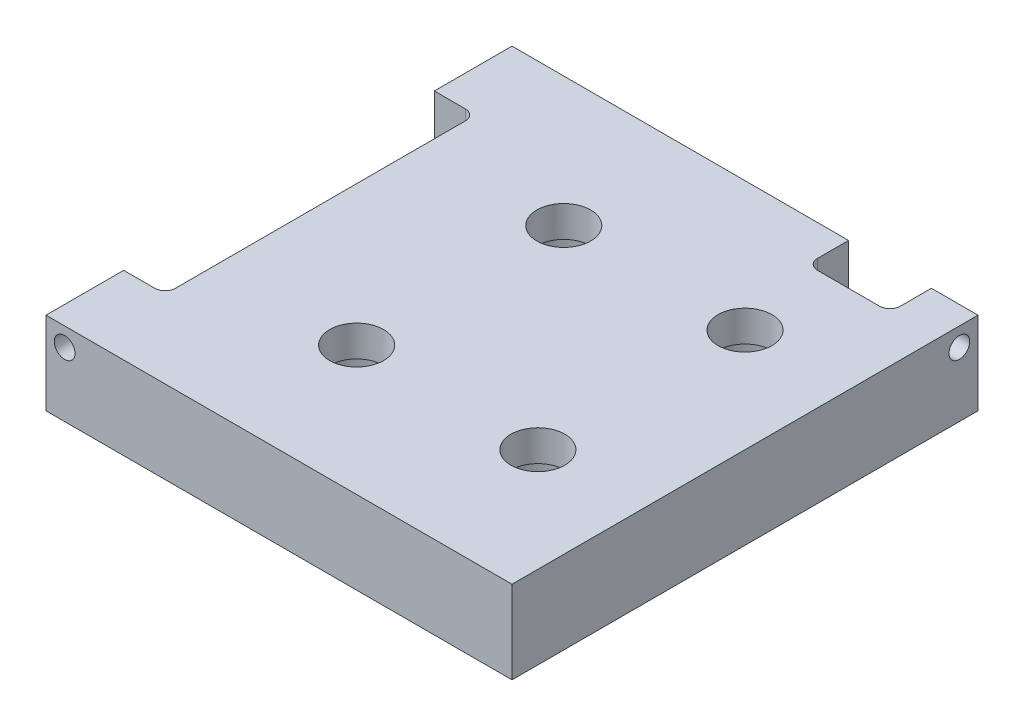
ISO-10303-21;
HEADER;
FILE_DESCRIPTION(('STEP AP214'),'2;1');
FILE_NAME('part.step','',(''),(''),'','','');
FILE_SCHEMA(('AUTOMOTIVE_DESIGN { 1 0 10303 214 1 1 1 1 }'));
ENDSEC;
DATA;
#1=APPLICATION_CONTEXT('core data for automotive mechanical design processes');
#2=APPLICATION_PROTOCOL_DEFINITION('international standard','automotive_design',2000,#1);
#3=PRODUCT_CONTEXT('',#1,'mechanical');
#4=PRODUCT('Part','Part','',(#3));
#5=PRODUCT_RELATED_PRODUCT_CATEGORY('part','',(#4));
#6=PRODUCT_DEFINITION_FORMATION('','',#4);
#7=PRODUCT_DEFINITION_CONTEXT('part definition',#1,'design');
#8=PRODUCT_DEFINITION('design','',#6,#7);
#9=PRODUCT_DEFINITION_SHAPE('','',#8);
#10=(LENGTH_UNIT() NAMED_UNIT(*) SI_UNIT(.MILLI.,.METRE.));
#11=(NAMED_UNIT(*) PLANE_ANGLE_UNIT() SI_UNIT($,.RADIAN.));
#12=(NAMED_UNIT(*) SI_UNIT($,.STERADIAN.) SOLID_ANGLE_UNIT());
#13=UNCERTAINTY_MEASURE_WITH_UNIT(LENGTH_MEASURE(1.E-05),#10,'distance_accuracy_value','');
#14=(GEOMETRIC_REPRESENTATION_CONTEXT(3) GLOBAL_UNCERTAINTY_ASSIGNED_CONTEXT((#13)) GLOBAL_UNIT_ASSIGNED_CONTEXT((#10,
#11,#12)) REPRESENTATION_CONTEXT('',''));
#15=CARTESIAN_POINT('',(0.,0.,0.));
#16=DIRECTION('',(0.,0.,1.));
#17=DIRECTION('',(1.,0.,0.));
#18=AXIS2_PLACEMENT_3D('',#15,#16,#17);
#19=CARTESIAN_POINT('',(17.5,0.,-12.5));
#20=DIRECTION('',(0.,1.,0.));
#21=DIRECTION('',(0.,0.,1.));
#22=AXIS2_PLACEMENT_3D('',#19,#20,#21);
#23=CYLINDRICAL_SURFACE('',#22,2.6);
#24=CARTESIAN_POINT('',(17.5,8.,-12.5));
#25=DIRECTION('',(0.,1.,0.));
#26=DIRECTION('',(0.,0.,1.));
#27=AXIS2_PLACEMENT_3D('',#24,#25,#26);
#28=CIRCLE('',#27,2.6);
#29=CARTESIAN_POINT('',(17.5,8.,-9.9));
#30=VERTEX_POINT('',#29);
#31=EDGE_CURVE('E247',#30,#30,#28,.T.);
#32=ORIENTED_EDGE('',*,*,#31,.T.);
#33=EDGE_LOOP('',(#32));
#34=FACE_BOUND('',#33,.T.);
#35=CARTESIAN_POINT('',(17.5,5.,-12.5));
#36=DIRECTION('',(0.,-1.,0.));
#37=DIRECTION('',(0.,0.,-1.));
#38=AXIS2_PLACEMENT_3D('',#35,#36,#37);
#39=CIRCLE('',#38,2.6);
#40=CARTESIAN_POINT('',(17.5,5.,-15.1));
#41=VERTEX_POINT('',#40);
#42=EDGE_CURVE('E243',#41,#41,#39,.F.);
#43=ORIENTED_EDGE('',*,*,#42,.F.);
#44=EDGE_LOOP('',(#43));
#45=FACE_BOUND('',#44,.T.);
#46=ADVANCED_FACE('F38',(#34,#45),#23,.F.);
#47=CARTESIAN_POINT('',(35.,0.,-32.5));
#48=DIRECTION('',(0.,1.,0.));
#49=DIRECTION('',(0.,0.,1.));
#50=AXIS2_PLACEMENT_3D('',#47,#48,#49);
#51=CYLINDRICAL_SURFACE('',#50,2.6);
#52=CARTESIAN_POINT('',(35.,8.,-32.5));
#53=DIRECTION('',(0.,1.,0.));
#54=DIRECTION('',(0.,0.,1.));
#55=AXIS2_PLACEMENT_3D('',#52,#53,#54);
#56=CIRCLE('',#55,2.6);
#57=CARTESIAN_POINT('',(35.,8.,-29.9));
#58=VERTEX_POINT('',#57);
#59=EDGE_CURVE('E239',#58,#58,#56,.T.);
#60=ORIENTED_EDGE('',*,*,#59,.T.);
#61=EDGE_LOOP('',(#60));
#62=FACE_BOUND('',#61,.T.);
#63=CARTESIAN_POINT('',(35.,5.,-32.5));
#64=DIRECTION('',(0.,-1.,0.));
#65=DIRECTION('',(0.,0.,-1.));
#66=AXIS2_PLACEMENT_3D('',#63,#64,#65);
#67=CIRCLE('',#66,2.6);
#68=CARTESIAN_POINT('',(35.,5.,-35.1));
#69=VERTEX_POINT('',#68);
#70=EDGE_CURVE('E290',#69,#69,#67,.F.);
#71=ORIENTED_EDGE('',*,*,#70,.F.);
#72=EDGE_LOOP('',(#71));
#73=FACE_BOUND('',#72,.T.);
#74=ADVANCED_FACE('F392',(#62,#73),#51,.F.);
#75=CARTESIAN_POINT('',(35.,0.,-12.5));
#76=DIRECTION('',(0.,1.,0.));
#77=DIRECTION('',(0.,0.,1.));
#78=AXIS2_PLACEMENT_3D('',#75,#76,#77);
#79=CYLINDRICAL_SURFACE('',#78,2.6);
#80=CARTESIAN_POINT('',(35.,8.,-12.5));
#81=DIRECTION('',(0.,1.,0.));
#82=DIRECTION('',(0.,0.,1.));
#83=AXIS2_PLACEMENT_3D('',#80,#81,#82);
#84=CIRCLE('',#83,2.6);
#85=CARTESIAN_POINT('',(35.,8.,-9.9));
#86=VERTEX_POINT('',#85);
#87=EDGE_CURVE('E242',#86,#86,#84,.T.);
#88=ORIENTED_EDGE('',*,*,#87,.T.);
#89=EDGE_LOOP('',(#88));
#90=FACE_BOUND('',#89,.T.);
#91=CARTESIAN_POINT('',(35.,5.,-12.5));
#92=DIRECTION('',(0.,-1.,0.));
#93=DIRECTION('',(0.,0.,-1.));
#94=AXIS2_PLACEMENT_3D('',#91,#92,#93);
#95=CIRCLE('',#94,2.6);
#96=CARTESIAN_POINT('',(35.,5.,-15.1));
#97=VERTEX_POINT('',#96);
#98=EDGE_CURVE('E287',#97,#97,#95,.F.);
#99=ORIENTED_EDGE('',*,*,#98,.F.);
#100=EDGE_LOOP('',(#99));
#101=FACE_BOUND('',#100,.T.);
#102=ADVANCED_FACE('F398',(#90,#101),#79,.F.);
#103=CARTESIAN_POINT('',(17.5,0.,-32.5));
#104=DIRECTION('',(0.,1.,0.));
#105=DIRECTION('',(0.,0.,1.));
#106=AXIS2_PLACEMENT_3D('',#103,#104,#105);
#107=CYLINDRICAL_SURFACE('',#106,2.6);
#108=CARTESIAN_POINT('',(17.5,8.,-32.5));
#109=DIRECTION('',(0.,1.,0.));
#110=DIRECTION('',(0.,0.,1.));
#111=AXIS2_PLACEMENT_3D('',#108,#109,#110);
#112=CIRCLE('',#111,2.6);
#113=CARTESIAN_POINT('',(17.5,8.,-29.9));
#114=VERTEX_POINT('',#113);
#115=EDGE_CURVE('E244',#114,#114,#112,.T.);
#116=ORIENTED_EDGE('',*,*,#115,.T.);
#117=EDGE_LOOP('',(#116));
#118=FACE_BOUND('',#117,.T.);
#119=CARTESIAN_POINT('',(17.5,5.,-32.5));
#120=DIRECTION('',(0.,-1.,0.));
#121=DIRECTION('',(0.,0.,-1.));
#122=AXIS2_PLACEMENT_3D('',#119,#120,#121);
#123=CIRCLE('',#122,2.6);
#124=CARTESIAN_POINT('',(17.5,5.,-35.1));
#125=VERTEX_POINT('',#124);
#126=EDGE_CURVE('E236',#125,#125,#123,.F.);
#127=ORIENTED_EDGE('',*,*,#126,.F.);
#128=EDGE_LOOP('',(#127));
#129=FACE_BOUND('',#128,.T.);
#130=ADVANCED_FACE('F424',(#118,#129),#107,.F.);
#131=CARTESIAN_POINT('',(0.,8.,0.));
#132=DIRECTION('',(1.,0.,0.));
#133=DIRECTION('',(0.,0.,-1.));
#134=AXIS2_PLACEMENT_3D('',#131,#132,#133);
#135=PLANE('',#134);
#136=DIRECTION('',(0.,0.,1.));
#137=VECTOR('',#136,1.);
#138=CARTESIAN_POINT('',(0.,4.,-37.5));
#139=LINE('',#138,#137);
#140=CARTESIAN_POINT('',(0.,4.,-37.5));
#141=VERTEX_POINT('',#140);
#142=CARTESIAN_POINT('',(0.,4.,-7.5));
#143=VERTEX_POINT('',#142);
#144=EDGE_CURVE('E190',#141,#143,#139,.T.);
#145=ORIENTED_EDGE('',*,*,#144,.F.);
#146=DIRECTION('',(0.,1.,0.));
#147=VECTOR('',#146,1.);
#148=CARTESIAN_POINT('',(0.,4.,-37.5));
#149=LINE('',#148,#147);
#150=CARTESIAN_POINT('',(0.,8.,-37.5));
#151=VERTEX_POINT('',#150);
#152=EDGE_CURVE('E210',#141,#151,#149,.T.);
#153=ORIENTED_EDGE('',*,*,#152,.T.);
#154=DIRECTION('',(0.,0.,1.));
#155=VECTOR('',#154,1.);
#156=CARTESIAN_POINT('',(0.,8.,0.));
#157=LINE('',#156,#155);
#158=CARTESIAN_POINT('',(0.,8.,-45.));
#159=VERTEX_POINT('',#158);
#160=EDGE_CURVE('E253',#159,#151,#157,.T.);
#161=ORIENTED_EDGE('',*,*,#160,.F.);
#162=DIRECTION('',(0.,-1.,0.));
#163=VECTOR('',#162,1.);
#164=CARTESIAN_POINT('',(0.,8.,-45.));
#165=LINE('',#164,#163);
#166=CARTESIAN_POINT('',(0.,0.,-45.));
#167=VERTEX_POINT('',#166);
#168=EDGE_CURVE('E264',#159,#167,#165,.T.);
#169=ORIENTED_EDGE('',*,*,#168,.T.);
#170=DIRECTION('',(0.,0.,1.));
#171=VECTOR('',#170,1.);
#172=CARTESIAN_POINT('',(0.,0.,0.));
#173=LINE('',#172,#171);
#174=CARTESIAN_POINT('',(0.,0.,0.));
#175=VERTEX_POINT('',#174);
#176=EDGE_CURVE('E252',#167,#175,#173,.T.);
#177=ORIENTED_EDGE('',*,*,#176,.T.);
#178=DIRECTION('',(0.,-1.,0.));
#179=VECTOR('',#178,1.);
#180=CARTESIAN_POINT('',(0.,8.,0.));
#181=LINE('',#180,#179);
#182=CARTESIAN_POINT('',(0.,8.,0.));
#183=VERTEX_POINT('',#182);
#184=EDGE_CURVE('E281',#183,#175,#181,.T.);
#185=ORIENTED_EDGE('',*,*,#184,.F.);
#186=CARTESIAN_POINT('',(0.,8.,-7.5));
#187=VERTEX_POINT('',#186);
#188=EDGE_CURVE('E257',#187,#183,#157,.T.);
#189=ORIENTED_EDGE('',*,*,#188,.F.);
#190=DIRECTION('',(0.,1.,0.));
#191=VECTOR('',#190,1.);
#192=CARTESIAN_POINT('',(0.,4.,-7.5));
#193=LINE('',#192,#191);
#194=EDGE_CURVE('E202',#143,#187,#193,.T.);
#195=ORIENTED_EDGE('',*,*,#194,.F.);
#196=EDGE_LOOP('',(#145,#153,#161,#169,#177,#185,#189,#195));
#197=FACE_BOUND('',#196,.T.);
#198=ADVANCED_FACE('F352',(#197),#135,.F.);
#199=CARTESIAN_POINT('',(0.,8.,0.));
#200=DIRECTION('',(0.,0.,-1.));
#201=DIRECTION('',(-1.,0.,0.));
#202=AXIS2_PLACEMENT_3D('',#199,#200,#201);
#203=PLANE('',#202);
#204=CARTESIAN_POINT('',(1.8,6.2,0.));
#205=DIRECTION('',(0.,0.,1.));
#206=DIRECTION('',(1.,0.,0.));
#207=AXIS2_PLACEMENT_3D('',#204,#205,#206);
#208=CIRCLE('',#207,1.);
#209=CARTESIAN_POINT('',(2.8,6.2,0.));
#210=VERTEX_POINT('',#209);
#211=EDGE_CURVE('E185',#210,#210,#208,.T.);
#212=ORIENTED_EDGE('',*,*,#211,.F.);
#213=EDGE_LOOP('',(#212));
#214=FACE_BOUND('',#213,.T.);
#215=DIRECTION('',(1.,0.,0.));
#216=VECTOR('',#215,1.);
#217=CARTESIAN_POINT('',(0.,0.,0.));
#218=LINE('',#217,#216);
#219=CARTESIAN_POINT('',(45.,0.,0.));
#220=VERTEX_POINT('',#219);
#221=EDGE_CURVE('E267',#175,#220,#218,.T.);
#222=ORIENTED_EDGE('',*,*,#221,.T.);
#223=DIRECTION('',(0.,-1.,0.));
#224=VECTOR('',#223,1.);
#225=CARTESIAN_POINT('',(45.,8.,0.));
#226=LINE('',#225,#224);
#227=CARTESIAN_POINT('',(45.,8.,0.));
#228=VERTEX_POINT('',#227);
#229=EDGE_CURVE('E278',#228,#220,#226,.T.);
#230=ORIENTED_EDGE('',*,*,#229,.F.);
#231=DIRECTION('',(1.,0.,0.));
#232=VECTOR('',#231,1.);
#233=CARTESIAN_POINT('',(0.,8.,0.));
#234=LINE('',#233,#232);
#235=EDGE_CURVE('E256',#183,#228,#234,.T.);
#236=ORIENTED_EDGE('',*,*,#235,.F.);
#237=ORIENTED_EDGE('',*,*,#184,.T.);
#238=EDGE_LOOP('',(#222,#230,#236,#237));
#239=FACE_BOUND('',#238,.T.);
#240=ADVANCED_FACE('F417',(#214,#239),#203,.F.);
#241=CARTESIAN_POINT('',(45.,8.,0.));
#242=DIRECTION('',(-1.,0.,0.));
#243=DIRECTION('',(0.,0.,1.));
#244=AXIS2_PLACEMENT_3D('',#241,#242,#243);
#245=PLANE('',#244);
#246=CARTESIAN_POINT('',(45.,6.2,-43.2));
#247=DIRECTION('',(1.,0.,0.));
#248=DIRECTION('',(0.,0.,-1.));
#249=AXIS2_PLACEMENT_3D('',#246,#247,#248);
#250=CIRCLE('',#249,0.999999999999998);
#251=CARTESIAN_POINT('',(45.,6.2,-44.2));
#252=VERTEX_POINT('',#251);
#253=EDGE_CURVE('E740',#252,#252,#250,.T.);
#254=ORIENTED_EDGE('',*,*,#253,.F.);
#255=EDGE_LOOP('',(#254));
#256=FACE_BOUND('',#255,.T.);
#257=DIRECTION('',(0.,0.,-1.));
#258=VECTOR('',#257,1.);
#259=CARTESIAN_POINT('',(45.,0.,0.));
#260=LINE('',#259,#258);
#261=CARTESIAN_POINT('',(45.,0.,-45.));
#262=VERTEX_POINT('',#261);
#263=EDGE_CURVE('E269',#220,#262,#260,.T.);
#264=ORIENTED_EDGE('',*,*,#263,.T.);
#265=DIRECTION('',(0.,-1.,0.));
#266=VECTOR('',#265,1.);
#267=CARTESIAN_POINT('',(45.,8.,-45.));
#268=LINE('',#267,#266);
#269=CARTESIAN_POINT('',(45.,8.,-45.));
#270=VERTEX_POINT('',#269);
#271=EDGE_CURVE('E275',#270,#262,#268,.T.);
#272=ORIENTED_EDGE('',*,*,#271,.F.);
#273=DIRECTION('',(0.,0.,-1.));
#274=VECTOR('',#273,1.);
#275=CARTESIAN_POINT('',(45.,8.,0.));
#276=LINE('',#275,#274);
#277=EDGE_CURVE('E259',#228,#270,#276,.T.);
#278=ORIENTED_EDGE('',*,*,#277,.F.);
#279=ORIENTED_EDGE('',*,*,#229,.T.);
#280=EDGE_LOOP('',(#264,#272,#278,#279));
#281=FACE_BOUND('',#280,.T.);
#282=ADVANCED_FACE('F414',(#256,#281),#245,.F.);
#283=CARTESIAN_POINT('',(0.,8.,-45.));
#284=DIRECTION('',(0.,0.,1.));
#285=DIRECTION('',(1.,0.,0.));
#286=AXIS2_PLACEMENT_3D('',#283,#284,#285);
#287=PLANE('',#286);
#288=DIRECTION('',(-1.,0.,0.));
#289=VECTOR('',#288,1.);
#290=CARTESIAN_POINT('',(40.5,4.,-45.));
#291=LINE('',#290,#289);
#292=CARTESIAN_POINT('',(40.5,4.,-45.));
#293=VERTEX_POINT('',#292);
#294=CARTESIAN_POINT('',(32.5,4.,-45.));
#295=VERTEX_POINT('',#294);
#296=EDGE_CURVE('E155',#293,#295,#291,.T.);
#297=ORIENTED_EDGE('',*,*,#296,.F.);
#298=DIRECTION('',(0.,1.,0.));
#299=VECTOR('',#298,1.);
#300=CARTESIAN_POINT('',(40.5,4.,-45.));
#301=LINE('',#300,#299);
#302=CARTESIAN_POINT('',(40.5,8.,-45.));
#303=VERTEX_POINT('',#302);
#304=EDGE_CURVE('E161',#293,#303,#301,.T.);
#305=ORIENTED_EDGE('',*,*,#304,.T.);
#306=DIRECTION('',(-1.,0.,0.));
#307=VECTOR('',#306,1.);
#308=CARTESIAN_POINT('',(0.,8.,-45.));
#309=LINE('',#308,#307);
#310=EDGE_CURVE('E262',#270,#303,#309,.T.);
#311=ORIENTED_EDGE('',*,*,#310,.F.);
#312=ORIENTED_EDGE('',*,*,#271,.T.);
#313=DIRECTION('',(-1.,0.,0.));
#314=VECTOR('',#313,1.);
#315=CARTESIAN_POINT('',(0.,0.,-45.));
#316=LINE('',#315,#314);
#317=EDGE_CURVE('E271',#262,#167,#316,.T.);
#318=ORIENTED_EDGE('',*,*,#317,.T.);
#319=ORIENTED_EDGE('',*,*,#168,.F.);
#320=CARTESIAN_POINT('',(32.5,8.,-45.));
#321=VERTEX_POINT('',#320);
#322=EDGE_CURVE('E261',#321,#159,#309,.T.);
#323=ORIENTED_EDGE('',*,*,#322,.F.);
#324=DIRECTION('',(0.,1.,0.));
#325=VECTOR('',#324,1.);
#326=CARTESIAN_POINT('',(32.5,4.,-45.));
#327=LINE('',#326,#325);
#328=EDGE_CURVE('E168',#295,#321,#327,.T.);
#329=ORIENTED_EDGE('',*,*,#328,.F.);
#330=EDGE_LOOP('',(#297,#305,#311,#312,#318,#319,#323,#329));
#331=FACE_BOUND('',#330,.T.);
#332=ADVANCED_FACE('F171',(#331),#287,.F.);
#333=CARTESIAN_POINT('',(0.,8.,0.));
#334=DIRECTION('',(0.,-1.,0.));
#335=DIRECTION('',(0.,0.,-1.));
#336=AXIS2_PLACEMENT_3D('',#333,#334,#335);
#337=PLANE('',#336);
#338=ORIENTED_EDGE('',*,*,#115,.F.);
#339=EDGE_LOOP('',(#338));
#340=FACE_BOUND('',#339,.T.);
#341=ORIENTED_EDGE('',*,*,#87,.F.);
#342=EDGE_LOOP('',(#341));
#343=FACE_BOUND('',#342,.T.);
#344=ORIENTED_EDGE('',*,*,#59,.F.);
#345=EDGE_LOOP('',(#344));
#346=FACE_BOUND('',#345,.T.);
#347=ORIENTED_EDGE('',*,*,#31,.F.);
#348=EDGE_LOOP('',(#347));
#349=FACE_BOUND('',#348,.T.);
#350=ORIENTED_EDGE('',*,*,#310,.T.);
#351=DIRECTION('',(0.,0.,-1.));
#352=VECTOR('',#351,1.);
#353=CARTESIAN_POINT('',(40.5,8.,-41.));
#354=LINE('',#353,#352);
#355=CARTESIAN_POINT('',(40.5,8.,-42.));
#356=VERTEX_POINT('',#355);
#357=EDGE_CURVE('E164',#356,#303,#354,.T.);
#358=ORIENTED_EDGE('',*,*,#357,.F.);
#359=CARTESIAN_POINT('',(39.5,8.,-42.));
#360=DIRECTION('',(0.,-1.,0.));
#361=DIRECTION('',(0.,0.,-1.));
#362=AXIS2_PLACEMENT_3D('',#359,#360,#361);
#363=CIRCLE('',#362,1.);
#364=CARTESIAN_POINT('',(39.5,8.,-41.));
#365=VERTEX_POINT('',#364);
#366=EDGE_CURVE('E11',#356,#365,#363,.T.);
#367=ORIENTED_EDGE('',*,*,#366,.T.);
#368=DIRECTION('',(1.,0.,0.));
#369=VECTOR('',#368,1.);
#370=CARTESIAN_POINT('',(40.5,8.,-41.));
#371=LINE('',#370,#369);
#372=CARTESIAN_POINT('',(33.5,8.,-41.));
#373=VERTEX_POINT('',#372);
#374=EDGE_CURVE('E158',#373,#365,#371,.T.);
#375=ORIENTED_EDGE('',*,*,#374,.F.);
#376=CARTESIAN_POINT('',(33.5,8.,-42.));
#377=DIRECTION('',(0.,-1.,0.));
#378=DIRECTION('',(0.,0.,-1.));
#379=AXIS2_PLACEMENT_3D('',#376,#377,#378);
#380=CIRCLE('',#379,1.);
#381=CARTESIAN_POINT('',(32.5,8.,-42.));
#382=VERTEX_POINT('',#381);
#383=EDGE_CURVE('E47',#373,#382,#380,.T.);
#384=ORIENTED_EDGE('',*,*,#383,.T.);
#385=DIRECTION('',(0.,0.,1.));
#386=VECTOR('',#385,1.);
#387=CARTESIAN_POINT('',(32.5,8.,-41.));
#388=LINE('',#387,#386);
#389=EDGE_CURVE('E180',#321,#382,#388,.T.);
#390=ORIENTED_EDGE('',*,*,#389,.F.);
#391=ORIENTED_EDGE('',*,*,#322,.T.);
#392=ORIENTED_EDGE('',*,*,#160,.T.);
#393=DIRECTION('',(-1.,0.,0.));
#394=VECTOR('',#393,1.);
#395=CARTESIAN_POINT('',(0.,8.,-37.5));
#396=LINE('',#395,#394);
#397=CARTESIAN_POINT('',(3.,8.,-37.5));
#398=VERTEX_POINT('',#397);
#399=EDGE_CURVE('E194',#398,#151,#396,.T.);
#400=ORIENTED_EDGE('',*,*,#399,.F.);
#401=CARTESIAN_POINT('',(3.,8.,-36.5));
#402=DIRECTION('',(0.,-1.,0.));
#403=DIRECTION('',(0.,0.,-1.));
#404=AXIS2_PLACEMENT_3D('',#401,#402,#403);
#405=CIRCLE('',#404,1.);
#406=CARTESIAN_POINT('',(4.,8.,-36.5));
#407=VERTEX_POINT('',#406);
#408=EDGE_CURVE('E310',#398,#407,#405,.T.);
#409=ORIENTED_EDGE('',*,*,#408,.T.);
#410=DIRECTION('',(0.,0.,-1.));
#411=VECTOR('',#410,1.);
#412=CARTESIAN_POINT('',(4.,8.,-37.5));
#413=LINE('',#412,#411);
#414=CARTESIAN_POINT('',(4.,8.,-8.5));
#415=VERTEX_POINT('',#414);
#416=EDGE_CURVE('E206',#415,#407,#413,.T.);
#417=ORIENTED_EDGE('',*,*,#416,.F.);
#418=CARTESIAN_POINT('',(3.,8.,-8.5));
#419=DIRECTION('',(0.,-1.,0.));
#420=DIRECTION('',(0.,0.,-1.));
#421=AXIS2_PLACEMENT_3D('',#418,#419,#420);
#422=CIRCLE('',#421,1.);
#423=CARTESIAN_POINT('',(3.,8.,-7.5));
#424=VERTEX_POINT('',#423);
#425=EDGE_CURVE('E312',#415,#424,#422,.T.);
#426=ORIENTED_EDGE('',*,*,#425,.T.);
#427=DIRECTION('',(1.,0.,0.));
#428=VECTOR('',#427,1.);
#429=CARTESIAN_POINT('',(0.,8.,-7.5));
#430=LINE('',#429,#428);
#431=EDGE_CURVE('E203',#187,#424,#430,.T.);
#432=ORIENTED_EDGE('',*,*,#431,.F.);
#433=ORIENTED_EDGE('',*,*,#188,.T.);
#434=ORIENTED_EDGE('',*,*,#235,.T.);
#435=ORIENTED_EDGE('',*,*,#277,.T.);
#436=EDGE_LOOP('',(#350,#358,#367,#375,#384,#390,#391,#392,#400,#409,#417,#426,#432,#433,#434,#435));
#437=FACE_BOUND('',#436,.T.);
#438=ADVANCED_FACE('F329',(#340,#343,#346,#349,#437),#337,.F.);
#439=CARTESIAN_POINT('',(0.,0.,0.));
#440=DIRECTION('',(0.,-1.,0.));
#441=DIRECTION('',(0.,0.,-1.));
#442=AXIS2_PLACEMENT_3D('',#439,#440,#441);
#443=PLANE('',#442);
#444=CARTESIAN_POINT('',(41.,0.,-4.));
#445=DIRECTION('',(0.,-1.,0.));
#446=DIRECTION('',(0.,0.,-1.));
#447=AXIS2_PLACEMENT_3D('',#444,#445,#446);
#448=CIRCLE('',#447,1.5);
#449=CARTESIAN_POINT('',(41.,0.,-5.50000000000001));
#450=VERTEX_POINT('',#449);
#451=EDGE_CURVE('E721',#450,#450,#448,.T.);
#452=ORIENTED_EDGE('',*,*,#451,.F.);
#453=EDGE_LOOP('',(#452));
#454=FACE_BOUND('',#453,.T.);
#455=CARTESIAN_POINT('',(4.00000000000001,0.,-41.));
#456=DIRECTION('',(0.,-1.,0.));
#457=DIRECTION('',(0.,0.,-1.));
#458=AXIS2_PLACEMENT_3D('',#455,#456,#457);
#459=CIRCLE('',#458,1.5);
#460=CARTESIAN_POINT('',(4.00000000000001,0.,-42.5));
#461=VERTEX_POINT('',#460);
#462=EDGE_CURVE('E735',#461,#461,#459,.T.);
#463=ORIENTED_EDGE('',*,*,#462,.F.);
#464=EDGE_LOOP('',(#463));
#465=FACE_BOUND('',#464,.T.);
#466=CARTESIAN_POINT('',(41.,0.,-41.));
#467=DIRECTION('',(0.,-1.,0.));
#468=DIRECTION('',(0.,0.,-1.));
#469=AXIS2_PLACEMENT_3D('',#466,#467,#468);
#470=CIRCLE('',#469,1.5);
#471=CARTESIAN_POINT('',(41.,0.,-42.5));
#472=VERTEX_POINT('',#471);
#473=EDGE_CURVE('E730',#472,#472,#470,.T.);
#474=ORIENTED_EDGE('',*,*,#473,.F.);
#475=EDGE_LOOP('',(#474));
#476=FACE_BOUND('',#475,.T.);
#477=CARTESIAN_POINT('',(4.00000000000001,0.,-4.));
#478=DIRECTION('',(0.,-1.,0.));
#479=DIRECTION('',(0.,0.,-1.));
#480=AXIS2_PLACEMENT_3D('',#477,#478,#479);
#481=CIRCLE('',#480,1.5);
#482=CARTESIAN_POINT('',(4.00000000000001,0.,-5.5));
#483=VERTEX_POINT('',#482);
#484=EDGE_CURVE('E720',#483,#483,#481,.T.);
#485=ORIENTED_EDGE('',*,*,#484,.F.);
#486=EDGE_LOOP('',(#485));
#487=FACE_BOUND('',#486,.T.);
#488=CARTESIAN_POINT('',(35.,0.,-32.5));
#489=DIRECTION('',(0.,-1.,0.));
#490=DIRECTION('',(0.,0.,-1.));
#491=AXIS2_PLACEMENT_3D('',#488,#489,#490);
#492=CIRCLE('',#491,4.4);
#493=CARTESIAN_POINT('',(35.,0.,-36.9));
#494=VERTEX_POINT('',#493);
#495=EDGE_CURVE('E213',#494,#494,#492,.T.);
#496=ORIENTED_EDGE('',*,*,#495,.F.);
#497=EDGE_LOOP('',(#496));
#498=FACE_BOUND('',#497,.T.);
#499=CARTESIAN_POINT('',(35.,0.,-12.5));
#500=DIRECTION('',(0.,-1.,0.));
#501=DIRECTION('',(0.,0.,-1.));
#502=AXIS2_PLACEMENT_3D('',#499,#500,#501);
#503=CIRCLE('',#502,4.4);
#504=CARTESIAN_POINT('',(35.,0.,-16.9));
#505=VERTEX_POINT('',#504);
#506=EDGE_CURVE('E225',#505,#505,#503,.T.);
#507=ORIENTED_EDGE('',*,*,#506,.F.);
#508=EDGE_LOOP('',(#507));
#509=FACE_BOUND('',#508,.T.);
#510=CARTESIAN_POINT('',(17.5,0.,-12.5));
#511=DIRECTION('',(0.,-1.,0.));
#512=DIRECTION('',(0.,0.,-1.));
#513=AXIS2_PLACEMENT_3D('',#510,#511,#512);
#514=CIRCLE('',#513,4.4);
#515=CARTESIAN_POINT('',(17.5,0.,-16.9));
#516=VERTEX_POINT('',#515);
#517=EDGE_CURVE('E219',#516,#516,#514,.T.);
#518=ORIENTED_EDGE('',*,*,#517,.F.);
#519=EDGE_LOOP('',(#518));
#520=FACE_BOUND('',#519,.T.);
#521=CARTESIAN_POINT('',(17.5,0.,-32.5));
#522=DIRECTION('',(0.,-1.,0.));
#523=DIRECTION('',(0.,0.,-1.));
#524=AXIS2_PLACEMENT_3D('',#521,#522,#523);
#525=CIRCLE('',#524,4.4);
#526=CARTESIAN_POINT('',(17.5,0.,-36.9));
#527=VERTEX_POINT('',#526);
#528=EDGE_CURVE('E218',#527,#527,#525,.T.);
#529=ORIENTED_EDGE('',*,*,#528,.F.);
#530=EDGE_LOOP('',(#529));
#531=FACE_BOUND('',#530,.T.);
#532=ORIENTED_EDGE('',*,*,#176,.F.);
#533=ORIENTED_EDGE('',*,*,#317,.F.);
#534=ORIENTED_EDGE('',*,*,#263,.F.);
#535=ORIENTED_EDGE('',*,*,#221,.F.);
#536=EDGE_LOOP('',(#532,#533,#534,#535));
#537=FACE_BOUND('',#536,.T.);
#538=ADVANCED_FACE('F348',(#454,#465,#476,#487,#498,#509,#520,#531,#537),#443,.T.);
#539=CARTESIAN_POINT('',(17.5,5.,-32.5));
#540=DIRECTION('',(0.,-1.,0.));
#541=DIRECTION('',(0.,0.,-1.));
#542=AXIS2_PLACEMENT_3D('',#539,#540,#541);
#543=PLANE('',#542);
#544=CARTESIAN_POINT('',(17.5,5.,-32.5));
#545=DIRECTION('',(0.,-1.,0.));
#546=DIRECTION('',(0.,0.,-1.));
#547=AXIS2_PLACEMENT_3D('',#544,#545,#546);
#548=CIRCLE('',#547,4.4);
#549=CARTESIAN_POINT('',(17.5,5.,-36.9));
#550=VERTEX_POINT('',#549);
#551=EDGE_CURVE('E233',#550,#550,#548,.T.);
#552=ORIENTED_EDGE('',*,*,#551,.T.);
#553=EDGE_LOOP('',(#552));
#554=FACE_BOUND('',#553,.T.);
#555=ORIENTED_EDGE('',*,*,#126,.T.);
#556=EDGE_LOOP('',(#555));
#557=FACE_BOUND('',#556,.T.);
#558=ADVANCED_FACE('F410',(#554,#557),#543,.T.);
#559=CARTESIAN_POINT('',(17.5,5.,-32.5));
#560=DIRECTION('',(0.,-1.,0.));
#561=DIRECTION('',(0.,0.,-1.));
#562=AXIS2_PLACEMENT_3D('',#559,#560,#561);
#563=CYLINDRICAL_SURFACE('',#562,4.4);
#564=ORIENTED_EDGE('',*,*,#551,.F.);
#565=EDGE_LOOP('',(#564));
#566=FACE_BOUND('',#565,.T.);
#567=ORIENTED_EDGE('',*,*,#528,.T.);
#568=EDGE_LOOP('',(#567));
#569=FACE_BOUND('',#568,.T.);
#570=ADVANCED_FACE('F470',(#566,#569),#563,.F.);
#571=CARTESIAN_POINT('',(35.,5.,-12.5));
#572=DIRECTION('',(0.,-1.,0.));
#573=DIRECTION('',(0.,0.,-1.));
#574=AXIS2_PLACEMENT_3D('',#571,#572,#573);
#575=PLANE('',#574);
#576=CARTESIAN_POINT('',(35.,5.,-12.5));
#577=DIRECTION('',(0.,-1.,0.));
#578=DIRECTION('',(0.,0.,-1.));
#579=AXIS2_PLACEMENT_3D('',#576,#577,#578);
#580=CIRCLE('',#579,4.4);
#581=CARTESIAN_POINT('',(35.,5.,-16.9));
#582=VERTEX_POINT('',#581);
#583=EDGE_CURVE('E222',#582,#582,#580,.T.);
#584=ORIENTED_EDGE('',*,*,#583,.T.);
#585=EDGE_LOOP('',(#584));
#586=FACE_BOUND('',#585,.T.);
#587=ORIENTED_EDGE('',*,*,#98,.T.);
#588=EDGE_LOOP('',(#587));
#589=FACE_BOUND('',#588,.T.);
#590=ADVANCED_FACE('F466',(#586,#589),#575,.T.);
#591=CARTESIAN_POINT('',(35.,5.,-12.5));
#592=DIRECTION('',(0.,-1.,0.));
#593=DIRECTION('',(0.,0.,-1.));
#594=AXIS2_PLACEMENT_3D('',#591,#592,#593);
#595=CYLINDRICAL_SURFACE('',#594,4.4);
#596=ORIENTED_EDGE('',*,*,#583,.F.);
#597=EDGE_LOOP('',(#596));
#598=FACE_BOUND('',#597,.T.);
#599=ORIENTED_EDGE('',*,*,#506,.T.);
#600=EDGE_LOOP('',(#599));
#601=FACE_BOUND('',#600,.T.);
#602=ADVANCED_FACE('F469',(#598,#601),#595,.F.);
#603=CARTESIAN_POINT('',(35.,5.,-32.5));
#604=DIRECTION('',(0.,-1.,0.));
#605=DIRECTION('',(0.,0.,-1.));
#606=AXIS2_PLACEMENT_3D('',#603,#604,#605);
#607=PLANE('',#606);
#608=CARTESIAN_POINT('',(35.,5.,-32.5));
#609=DIRECTION('',(0.,-1.,0.));
#610=DIRECTION('',(0.,0.,-1.));
#611=AXIS2_PLACEMENT_3D('',#608,#609,#610);
#612=CIRCLE('',#611,4.4);
#613=CARTESIAN_POINT('',(35.,5.,-36.9));
#614=VERTEX_POINT('',#613);
#615=EDGE_CURVE('E228',#614,#614,#612,.T.);
#616=ORIENTED_EDGE('',*,*,#615,.T.);
#617=EDGE_LOOP('',(#616));
#618=FACE_BOUND('',#617,.T.);
#619=ORIENTED_EDGE('',*,*,#70,.T.);
#620=EDGE_LOOP('',(#619));
#621=FACE_BOUND('',#620,.T.);
#622=ADVANCED_FACE('F474',(#618,#621),#607,.T.);
#623=CARTESIAN_POINT('',(35.,5.,-32.5));
#624=DIRECTION('',(0.,-1.,0.));
#625=DIRECTION('',(0.,0.,-1.));
#626=AXIS2_PLACEMENT_3D('',#623,#624,#625);
#627=CYLINDRICAL_SURFACE('',#626,4.4);
#628=ORIENTED_EDGE('',*,*,#615,.F.);
#629=EDGE_LOOP('',(#628));
#630=FACE_BOUND('',#629,.T.);
#631=ORIENTED_EDGE('',*,*,#495,.T.);
#632=EDGE_LOOP('',(#631));
#633=FACE_BOUND('',#632,.T.);
#634=ADVANCED_FACE('F461',(#630,#633),#627,.F.);
#635=CARTESIAN_POINT('',(17.5,5.,-12.5));
#636=DIRECTION('',(0.,-1.,0.));
#637=DIRECTION('',(0.,0.,-1.));
#638=AXIS2_PLACEMENT_3D('',#635,#636,#637);
#639=PLANE('',#638);
#640=CARTESIAN_POINT('',(17.5,5.,-12.5));
#641=DIRECTION('',(0.,-1.,0.));
#642=DIRECTION('',(0.,0.,-1.));
#643=AXIS2_PLACEMENT_3D('',#640,#641,#642);
#644=CIRCLE('',#643,4.4);
#645=CARTESIAN_POINT('',(17.5,5.,-16.9));
#646=VERTEX_POINT('',#645);
#647=EDGE_CURVE('E215',#646,#646,#644,.T.);
#648=ORIENTED_EDGE('',*,*,#647,.T.);
#649=EDGE_LOOP('',(#648));
#650=FACE_BOUND('',#649,.T.);
#651=ORIENTED_EDGE('',*,*,#42,.T.);
#652=EDGE_LOOP('',(#651));
#653=FACE_BOUND('',#652,.T.);
#654=ADVANCED_FACE('F455',(#650,#653),#639,.T.);
#655=CARTESIAN_POINT('',(17.5,5.,-12.5));
#656=DIRECTION('',(0.,-1.,0.));
#657=DIRECTION('',(0.,0.,-1.));
#658=AXIS2_PLACEMENT_3D('',#655,#656,#657);
#659=CYLINDRICAL_SURFACE('',#658,4.4);
#660=ORIENTED_EDGE('',*,*,#647,.F.);
#661=EDGE_LOOP('',(#660));
#662=FACE_BOUND('',#661,.T.);
#663=ORIENTED_EDGE('',*,*,#517,.T.);
#664=EDGE_LOOP('',(#663));
#665=FACE_BOUND('',#664,.T.);
#666=ADVANCED_FACE('F451',(#662,#665),#659,.F.);
#667=CARTESIAN_POINT('',(0.,4.,-37.5));
#668=DIRECTION('',(0.,0.,-1.));
#669=DIRECTION('',(-1.,0.,0.));
#670=AXIS2_PLACEMENT_3D('',#667,#668,#669);
#671=PLANE('',#670);
#672=DIRECTION('',(-1.,0.,0.));
#673=VECTOR('',#672,1.);
#674=CARTESIAN_POINT('',(0.,4.,-37.5));
#675=LINE('',#674,#673);
#676=CARTESIAN_POINT('',(3.,4.,-37.5));
#677=VERTEX_POINT('',#676);
#678=EDGE_CURVE('E200',#677,#141,#675,.T.);
#679=ORIENTED_EDGE('',*,*,#678,.F.);
#680=DIRECTION('',(0.,1.,0.));
#681=VECTOR('',#680,1.);
#682=CARTESIAN_POINT('',(3.,8.,-37.5));
#683=LINE('',#682,#681);
#684=EDGE_CURVE('E284',#677,#398,#683,.T.);
#685=ORIENTED_EDGE('',*,*,#684,.T.);
#686=ORIENTED_EDGE('',*,*,#399,.T.);
#687=ORIENTED_EDGE('',*,*,#152,.F.);
#688=EDGE_LOOP('',(#679,#685,#686,#687));
#689=FACE_BOUND('',#688,.T.);
#690=ADVANCED_FACE('F360',(#689),#671,.F.);
#691=CARTESIAN_POINT('',(4.,4.,-37.5));
#692=DIRECTION('',(1.,0.,0.));
#693=DIRECTION('',(0.,0.,-1.));
#694=AXIS2_PLACEMENT_3D('',#691,#692,#693);
#695=PLANE('',#694);
#696=ORIENTED_EDGE('',*,*,#416,.T.);
#697=DIRECTION('',(0.,1.,0.));
#698=VECTOR('',#697,1.);
#699=CARTESIAN_POINT('',(4.,4.,-36.5));
#700=LINE('',#699,#698);
#701=CARTESIAN_POINT('',(4.,4.,-36.5));
#702=VERTEX_POINT('',#701);
#703=EDGE_CURVE('E302',#407,#702,#700,.F.);
#704=ORIENTED_EDGE('',*,*,#703,.T.);
#705=DIRECTION('',(0.,0.,-1.));
#706=VECTOR('',#705,1.);
#707=CARTESIAN_POINT('',(4.,4.,-37.5));
#708=LINE('',#707,#706);
#709=CARTESIAN_POINT('',(4.,4.,-8.5));
#710=VERTEX_POINT('',#709);
#711=EDGE_CURVE('E197',#710,#702,#708,.T.);
#712=ORIENTED_EDGE('',*,*,#711,.F.);
#713=DIRECTION('',(0.,1.,0.));
#714=VECTOR('',#713,1.);
#715=CARTESIAN_POINT('',(4.,8.,-8.5));
#716=LINE('',#715,#714);
#717=EDGE_CURVE('E299',#710,#415,#716,.T.);
#718=ORIENTED_EDGE('',*,*,#717,.T.);
#719=EDGE_LOOP('',(#696,#704,#712,#718));
#720=FACE_BOUND('',#719,.T.);
#721=ADVANCED_FACE('F372',(#720),#695,.F.);
#722=CARTESIAN_POINT('',(0.,4.,-7.5));
#723=DIRECTION('',(0.,0.,1.));
#724=DIRECTION('',(1.,0.,0.));
#725=AXIS2_PLACEMENT_3D('',#722,#723,#724);
#726=PLANE('',#725);
#727=CARTESIAN_POINT('',(1.8,6.2,-7.5));
#728=DIRECTION('',(0.,0.,1.));
#729=DIRECTION('',(1.,0.,0.));
#730=AXIS2_PLACEMENT_3D('',#727,#728,#729);
#731=CIRCLE('',#730,1.);
#732=CARTESIAN_POINT('',(2.8,6.2,-7.5));
#733=VERTEX_POINT('',#732);
#734=EDGE_CURVE('E189',#733,#733,#731,.T.);
#735=ORIENTED_EDGE('',*,*,#734,.T.);
#736=EDGE_LOOP('',(#735));
#737=FACE_BOUND('',#736,.T.);
#738=ORIENTED_EDGE('',*,*,#431,.T.);
#739=DIRECTION('',(0.,1.,0.));
#740=VECTOR('',#739,1.);
#741=CARTESIAN_POINT('',(3.,4.,-7.5));
#742=LINE('',#741,#740);
#743=CARTESIAN_POINT('',(3.,4.,-7.5));
#744=VERTEX_POINT('',#743);
#745=EDGE_CURVE('E308',#424,#744,#742,.F.);
#746=ORIENTED_EDGE('',*,*,#745,.T.);
#747=DIRECTION('',(1.,0.,0.));
#748=VECTOR('',#747,1.);
#749=CARTESIAN_POINT('',(0.,4.,-7.5));
#750=LINE('',#749,#748);
#751=EDGE_CURVE('E193',#143,#744,#750,.T.);
#752=ORIENTED_EDGE('',*,*,#751,.F.);
#753=ORIENTED_EDGE('',*,*,#194,.T.);
#754=EDGE_LOOP('',(#738,#746,#752,#753));
#755=FACE_BOUND('',#754,.T.);
#756=ADVANCED_FACE('F379',(#737,#755),#726,.F.);
#757=CARTESIAN_POINT('',(0.,4.,0.));
#758=DIRECTION('',(0.,1.,0.));
#759=DIRECTION('',(0.,0.,1.));
#760=AXIS2_PLACEMENT_3D('',#757,#758,#759);
#761=PLANE('',#760);
#762=ORIENTED_EDGE('',*,*,#711,.T.);
#763=CARTESIAN_POINT('',(3.,4.,-36.5));
#764=DIRECTION('',(0.,1.,0.));
#765=DIRECTION('',(0.,0.,1.));
#766=AXIS2_PLACEMENT_3D('',#763,#764,#765);
#767=CIRCLE('',#766,1.);
#768=EDGE_CURVE('E306',#702,#677,#767,.T.);
#769=ORIENTED_EDGE('',*,*,#768,.T.);
#770=ORIENTED_EDGE('',*,*,#678,.T.);
#771=ORIENTED_EDGE('',*,*,#144,.T.);
#772=ORIENTED_EDGE('',*,*,#751,.T.);
#773=CARTESIAN_POINT('',(3.,4.,-8.5));
#774=DIRECTION('',(0.,1.,0.));
#775=DIRECTION('',(0.,0.,1.));
#776=AXIS2_PLACEMENT_3D('',#773,#774,#775);
#777=CIRCLE('',#776,1.);
#778=EDGE_CURVE('E304',#744,#710,#777,.T.);
#779=ORIENTED_EDGE('',*,*,#778,.T.);
#780=EDGE_LOOP('',(#762,#769,#770,#771,#772,#779));
#781=FACE_BOUND('',#780,.T.);
#782=ADVANCED_FACE('F364',(#781),#761,.T.);
#783=CARTESIAN_POINT('',(1.8,6.2,-9.));
#784=DIRECTION('',(0.,0.,1.));
#785=DIRECTION('',(1.,0.,0.));
#786=AXIS2_PLACEMENT_3D('',#783,#784,#785);
#787=CYLINDRICAL_SURFACE('',#786,1.);
#788=ORIENTED_EDGE('',*,*,#211,.T.);
#789=EDGE_LOOP('',(#788));
#790=FACE_BOUND('',#789,.T.);
#791=ORIENTED_EDGE('',*,*,#734,.F.);
#792=EDGE_LOOP('',(#791));
#793=FACE_BOUND('',#792,.T.);
#794=ADVANCED_FACE('F387',(#790,#793),#787,.F.);
#795=CARTESIAN_POINT('',(3.,4.,-36.5));
#796=DIRECTION('',(0.,-1.,0.));
#797=DIRECTION('',(0.,0.,-1.));
#798=AXIS2_PLACEMENT_3D('',#795,#796,#797);
#799=CYLINDRICAL_SURFACE('',#798,1.);
#800=ORIENTED_EDGE('',*,*,#768,.F.);
#801=ORIENTED_EDGE('',*,*,#703,.F.);
#802=ORIENTED_EDGE('',*,*,#408,.F.);
#803=ORIENTED_EDGE('',*,*,#684,.F.);
#804=EDGE_LOOP('',(#800,#801,#802,#803));
#805=FACE_BOUND('',#804,.T.);
#806=ADVANCED_FACE('F368',(#805),#799,.F.);
#807=CARTESIAN_POINT('',(3.,4.,-8.5));
#808=DIRECTION('',(0.,-1.,0.));
#809=DIRECTION('',(0.,0.,-1.));
#810=AXIS2_PLACEMENT_3D('',#807,#808,#809);
#811=CYLINDRICAL_SURFACE('',#810,1.);
#812=ORIENTED_EDGE('',*,*,#778,.F.);
#813=ORIENTED_EDGE('',*,*,#745,.F.);
#814=ORIENTED_EDGE('',*,*,#425,.F.);
#815=ORIENTED_EDGE('',*,*,#717,.F.);
#816=EDGE_LOOP('',(#812,#813,#814,#815));
#817=FACE_BOUND('',#816,.T.);
#818=ADVANCED_FACE('F376',(#817),#811,.F.);
#819=CARTESIAN_POINT('',(40.5,4.,-41.));
#820=DIRECTION('',(1.,0.,0.));
#821=DIRECTION('',(0.,0.,-1.));
#822=AXIS2_PLACEMENT_3D('',#819,#820,#821);
#823=PLANE('',#822);
#824=CARTESIAN_POINT('',(40.5,6.2,-43.2));
#825=DIRECTION('',(1.,0.,0.));
#826=DIRECTION('',(0.,0.,-1.));
#827=AXIS2_PLACEMENT_3D('',#824,#825,#826);
#828=CIRCLE('',#827,0.999999999999998);
#829=CARTESIAN_POINT('',(40.5,6.2,-44.2));
#830=VERTEX_POINT('',#829);
#831=EDGE_CURVE('E42',#830,#830,#828,.T.);
#832=ORIENTED_EDGE('',*,*,#831,.T.);
#833=EDGE_LOOP('',(#832));
#834=FACE_BOUND('',#833,.T.);
#835=DIRECTION('',(0.,0.,-1.));
#836=VECTOR('',#835,1.);
#837=CARTESIAN_POINT('',(40.5,4.,-41.));
#838=LINE('',#837,#836);
#839=CARTESIAN_POINT('',(40.5,4.,-42.));
#840=VERTEX_POINT('',#839);
#841=EDGE_CURVE('E150',#840,#293,#838,.T.);
#842=ORIENTED_EDGE('',*,*,#841,.F.);
#843=DIRECTION('',(0.,1.,0.));
#844=VECTOR('',#843,1.);
#845=CARTESIAN_POINT('',(40.5,8.,-42.));
#846=LINE('',#845,#844);
#847=EDGE_CURVE('E324',#840,#356,#846,.T.);
#848=ORIENTED_EDGE('',*,*,#847,.T.);
#849=ORIENTED_EDGE('',*,*,#357,.T.);
#850=ORIENTED_EDGE('',*,*,#304,.F.);
#851=EDGE_LOOP('',(#842,#848,#849,#850));
#852=FACE_BOUND('',#851,.T.);
#853=ADVANCED_FACE('F162',(#834,#852),#823,.F.);
#854=CARTESIAN_POINT('',(40.5,4.,-41.));
#855=DIRECTION('',(0.,0.,1.));
#856=DIRECTION('',(1.,0.,0.));
#857=AXIS2_PLACEMENT_3D('',#854,#855,#856);
#858=PLANE('',#857);
#859=DIRECTION('',(1.,0.,0.));
#860=VECTOR('',#859,1.);
#861=CARTESIAN_POINT('',(40.5,4.,-41.));
#862=LINE('',#861,#860);
#863=CARTESIAN_POINT('',(33.5,4.,-41.));
#864=VERTEX_POINT('',#863);
#865=CARTESIAN_POINT('',(39.5,4.,-41.));
#866=VERTEX_POINT('',#865);
#867=EDGE_CURVE('E169',#864,#866,#862,.T.);
#868=ORIENTED_EDGE('',*,*,#867,.F.);
#869=DIRECTION('',(0.,1.,0.));
#870=VECTOR('',#869,1.);
#871=CARTESIAN_POINT('',(33.5,8.,-41.));
#872=LINE('',#871,#870);
#873=EDGE_CURVE('E316',#864,#373,#872,.T.);
#874=ORIENTED_EDGE('',*,*,#873,.T.);
#875=ORIENTED_EDGE('',*,*,#374,.T.);
#876=DIRECTION('',(0.,1.,0.));
#877=VECTOR('',#876,1.);
#878=CARTESIAN_POINT('',(39.5,4.,-41.));
#879=LINE('',#878,#877);
#880=EDGE_CURVE('E314',#365,#866,#879,.F.);
#881=ORIENTED_EDGE('',*,*,#880,.T.);
#882=EDGE_LOOP('',(#868,#874,#875,#881));
#883=FACE_BOUND('',#882,.T.);
#884=ADVANCED_FACE('F339',(#883),#858,.F.);
#885=CARTESIAN_POINT('',(32.5,4.,-41.));
#886=DIRECTION('',(-1.,0.,0.));
#887=DIRECTION('',(0.,0.,1.));
#888=AXIS2_PLACEMENT_3D('',#885,#886,#887);
#889=PLANE('',#888);
#890=ORIENTED_EDGE('',*,*,#389,.T.);
#891=DIRECTION('',(0.,1.,0.));
#892=VECTOR('',#891,1.);
#893=CARTESIAN_POINT('',(32.5,4.,-42.));
#894=LINE('',#893,#892);
#895=CARTESIAN_POINT('',(32.5,4.,-42.));
#896=VERTEX_POINT('',#895);
#897=EDGE_CURVE('E319',#382,#896,#894,.F.);
#898=ORIENTED_EDGE('',*,*,#897,.T.);
#899=DIRECTION('',(0.,0.,1.));
#900=VECTOR('',#899,1.);
#901=CARTESIAN_POINT('',(32.5,4.,-41.));
#902=LINE('',#901,#900);
#903=EDGE_CURVE('E173',#295,#896,#902,.T.);
#904=ORIENTED_EDGE('',*,*,#903,.F.);
#905=ORIENTED_EDGE('',*,*,#328,.T.);
#906=EDGE_LOOP('',(#890,#898,#904,#905));
#907=FACE_BOUND('',#906,.T.);
#908=ADVANCED_FACE('F334',(#907),#889,.F.);
#909=CARTESIAN_POINT('',(0.,4.,0.));
#910=DIRECTION('',(0.,1.,0.));
#911=DIRECTION('',(0.,0.,1.));
#912=AXIS2_PLACEMENT_3D('',#909,#910,#911);
#913=PLANE('',#912);
#914=ORIENTED_EDGE('',*,*,#903,.T.);
#915=CARTESIAN_POINT('',(33.5,4.,-42.));
#916=DIRECTION('',(0.,1.,0.));
#917=DIRECTION('',(0.,0.,1.));
#918=AXIS2_PLACEMENT_3D('',#915,#916,#917);
#919=CIRCLE('',#918,1.);
#920=EDGE_CURVE('E322',#896,#864,#919,.T.);
#921=ORIENTED_EDGE('',*,*,#920,.T.);
#922=ORIENTED_EDGE('',*,*,#867,.T.);
#923=CARTESIAN_POINT('',(39.5,4.,-42.));
#924=DIRECTION('',(0.,1.,0.));
#925=DIRECTION('',(0.,0.,1.));
#926=AXIS2_PLACEMENT_3D('',#923,#924,#925);
#927=CIRCLE('',#926,1.);
#928=EDGE_CURVE('E60',#866,#840,#927,.T.);
#929=ORIENTED_EDGE('',*,*,#928,.T.);
#930=ORIENTED_EDGE('',*,*,#841,.T.);
#931=ORIENTED_EDGE('',*,*,#296,.T.);
#932=EDGE_LOOP('',(#914,#921,#922,#929,#930,#931));
#933=FACE_BOUND('',#932,.T.);
#934=ADVANCED_FACE('F153',(#933),#913,.T.);
#935=CARTESIAN_POINT('',(33.5,4.,-42.));
#936=DIRECTION('',(0.,-1.,0.));
#937=DIRECTION('',(0.,0.,-1.));
#938=AXIS2_PLACEMENT_3D('',#935,#936,#937);
#939=CYLINDRICAL_SURFACE('',#938,1.);
#940=ORIENTED_EDGE('',*,*,#920,.F.);
#941=ORIENTED_EDGE('',*,*,#897,.F.);
#942=ORIENTED_EDGE('',*,*,#383,.F.);
#943=ORIENTED_EDGE('',*,*,#873,.F.);
#944=EDGE_LOOP('',(#940,#941,#942,#943));
#945=FACE_BOUND('',#944,.T.);
#946=ADVANCED_FACE('F336',(#945),#939,.F.);
#947=CARTESIAN_POINT('',(39.5,4.,-42.));
#948=DIRECTION('',(0.,-1.,0.));
#949=DIRECTION('',(0.,0.,-1.));
#950=AXIS2_PLACEMENT_3D('',#947,#948,#949);
#951=CYLINDRICAL_SURFACE('',#950,1.);
#952=ORIENTED_EDGE('',*,*,#928,.F.);
#953=ORIENTED_EDGE('',*,*,#880,.F.);
#954=ORIENTED_EDGE('',*,*,#366,.F.);
#955=ORIENTED_EDGE('',*,*,#847,.F.);
#956=EDGE_LOOP('',(#952,#953,#954,#955));
#957=FACE_BOUND('',#956,.T.);
#958=ADVANCED_FACE('F40',(#957),#951,.F.);
#959=CARTESIAN_POINT('',(36.,6.2,-43.2));
#960=DIRECTION('',(1.,0.,0.));
#961=DIRECTION('',(0.,0.,-1.));
#962=AXIS2_PLACEMENT_3D('',#959,#960,#961);
#963=CYLINDRICAL_SURFACE('',#962,0.999999999999998);
#964=ORIENTED_EDGE('',*,*,#253,.T.);
#965=EDGE_LOOP('',(#964));
#966=FACE_BOUND('',#965,.T.);
#967=ORIENTED_EDGE('',*,*,#831,.F.);
#968=EDGE_LOOP('',(#967));
#969=FACE_BOUND('',#968,.T.);
#970=ADVANCED_FACE('F433',(#966,#969),#963,.F.);
#971=CARTESIAN_POINT('',(4.00000000000001,3.,-4.));
#972=DIRECTION('',(0.,-1.,0.));
#973=DIRECTION('',(0.,0.,-1.));
#974=AXIS2_PLACEMENT_3D('',#971,#972,#973);
#975=CYLINDRICAL_SURFACE('',#974,1.5);
#976=CARTESIAN_POINT('',(4.00000000000001,3.,-4.));
#977=DIRECTION('',(0.,-1.,0.));
#978=DIRECTION('',(0.,0.,-1.));
#979=AXIS2_PLACEMENT_3D('',#976,#977,#978);
#980=CIRCLE('',#979,1.5);
#981=CARTESIAN_POINT('',(4.00000000000001,3.,-5.5));
#982=VERTEX_POINT('',#981);
#983=EDGE_CURVE('E724',#982,#982,#980,.T.);
#984=ORIENTED_EDGE('',*,*,#983,.F.);
#985=EDGE_LOOP('',(#984));
#986=FACE_BOUND('',#985,.T.);
#987=ORIENTED_EDGE('',*,*,#484,.T.);
#988=EDGE_LOOP('',(#987));
#989=FACE_BOUND('',#988,.T.);
#990=ADVANCED_FACE('F634',(#986,#989),#975,.F.);
#991=CARTESIAN_POINT('',(4.00000000000001,3.,-4.));
#992=DIRECTION('',(0.,-1.,0.));
#993=DIRECTION('',(0.,0.,-1.));
#994=AXIS2_PLACEMENT_3D('',#991,#992,#993);
#995=PLANE('',#994);
#996=ORIENTED_EDGE('',*,*,#983,.T.);
#997=EDGE_LOOP('',(#996));
#998=FACE_BOUND('',#997,.T.);
#999=ADVANCED_FACE('F643',(#998),#995,.T.);
#1000=CARTESIAN_POINT('',(41.,3.,-41.));
#1001=DIRECTION('',(0.,-1.,0.));
#1002=DIRECTION('',(0.,0.,-1.));
#1003=AXIS2_PLACEMENT_3D('',#1000,#1001,#1002);
#1004=CYLINDRICAL_SURFACE('',#1003,1.5);
#1005=CARTESIAN_POINT('',(41.,3.,-41.));
#1006=DIRECTION('',(0.,-1.,0.));
#1007=DIRECTION('',(0.,0.,-1.));
#1008=AXIS2_PLACEMENT_3D('',#1005,#1006,#1007);
#1009=CIRCLE('',#1008,1.5);
#1010=CARTESIAN_POINT('',(41.,3.,-42.5));
#1011=VERTEX_POINT('',#1010);
#1012=EDGE_CURVE('E738',#1011,#1011,#1009,.T.);
#1013=ORIENTED_EDGE('',*,*,#1012,.F.);
#1014=EDGE_LOOP('',(#1013));
#1015=FACE_BOUND('',#1014,.T.);
#1016=ORIENTED_EDGE('',*,*,#473,.T.);
#1017=EDGE_LOOP('',(#1016));
#1018=FACE_BOUND('',#1017,.T.);
#1019=ADVANCED_FACE('F651',(#1015,#1018),#1004,.F.);
#1020=CARTESIAN_POINT('',(41.,3.,-41.));
#1021=DIRECTION('',(0.,-1.,0.));
#1022=DIRECTION('',(0.,0.,-1.));
#1023=AXIS2_PLACEMENT_3D('',#1020,#1021,#1022);
#1024=PLANE('',#1023);
#1025=ORIENTED_EDGE('',*,*,#1012,.T.);
#1026=EDGE_LOOP('',(#1025));
#1027=FACE_BOUND('',#1026,.T.);
#1028=ADVANCED_FACE('F660',(#1027),#1024,.T.);
#1029=CARTESIAN_POINT('',(4.00000000000001,3.,-41.));
#1030=DIRECTION('',(0.,-1.,0.));
#1031=DIRECTION('',(0.,0.,-1.));
#1032=AXIS2_PLACEMENT_3D('',#1029,#1030,#1031);
#1033=CYLINDRICAL_SURFACE('',#1032,1.5);
#1034=CARTESIAN_POINT('',(4.00000000000001,3.,-41.));
#1035=DIRECTION('',(0.,-1.,0.));
#1036=DIRECTION('',(0.,0.,-1.));
#1037=AXIS2_PLACEMENT_3D('',#1034,#1035,#1036);
#1038=CIRCLE('',#1037,1.5);
#1039=CARTESIAN_POINT('',(4.00000000000001,3.,-42.5));
#1040=VERTEX_POINT('',#1039);
#1041=EDGE_CURVE('E727',#1040,#1040,#1038,.T.);
#1042=ORIENTED_EDGE('',*,*,#1041,.F.);
#1043=EDGE_LOOP('',(#1042));
#1044=FACE_BOUND('',#1043,.T.);
#1045=ORIENTED_EDGE('',*,*,#462,.T.);
#1046=EDGE_LOOP('',(#1045));
#1047=FACE_BOUND('',#1046,.T.);
#1048=ADVANCED_FACE('F669',(#1044,#1047),#1033,.F.);
#1049=CARTESIAN_POINT('',(4.00000000000001,3.,-41.));
#1050=DIRECTION('',(0.,-1.,0.));
#1051=DIRECTION('',(0.,0.,-1.));
#1052=AXIS2_PLACEMENT_3D('',#1049,#1050,#1051);
#1053=PLANE('',#1052);
#1054=ORIENTED_EDGE('',*,*,#1041,.T.);
#1055=EDGE_LOOP('',(#1054));
#1056=FACE_BOUND('',#1055,.T.);
#1057=ADVANCED_FACE('F678',(#1056),#1053,.T.);
#1058=CARTESIAN_POINT('',(41.,3.,-4.));
#1059=DIRECTION('',(0.,-1.,0.));
#1060=DIRECTION('',(0.,0.,-1.));
#1061=AXIS2_PLACEMENT_3D('',#1058,#1059,#1060);
#1062=CYLINDRICAL_SURFACE('',#1061,1.5);
#1063=CARTESIAN_POINT('',(41.,3.,-4.));
#1064=DIRECTION('',(0.,-1.,0.));
#1065=DIRECTION('',(0.,0.,-1.));
#1066=AXIS2_PLACEMENT_3D('',#1063,#1064,#1065);
#1067=CIRCLE('',#1066,1.5);
#1068=CARTESIAN_POINT('',(41.,3.,-5.50000000000001));
#1069=VERTEX_POINT('',#1068);
#1070=EDGE_CURVE('E719',#1069,#1069,#1067,.T.);
#1071=ORIENTED_EDGE('',*,*,#1070,.F.);
#1072=EDGE_LOOP('',(#1071));
#1073=FACE_BOUND('',#1072,.T.);
#1074=ORIENTED_EDGE('',*,*,#451,.T.);
#1075=EDGE_LOOP('',(#1074));
#1076=FACE_BOUND('',#1075,.T.);
#1077=ADVANCED_FACE('F687',(#1073,#1076),#1062,.F.);
#1078=CARTESIAN_POINT('',(41.,3.,-4.));
#1079=DIRECTION('',(0.,-1.,0.));
#1080=DIRECTION('',(0.,0.,-1.));
#1081=AXIS2_PLACEMENT_3D('',#1078,#1079,#1080);
#1082=PLANE('',#1081);
#1083=ORIENTED_EDGE('',*,*,#1070,.T.);
#1084=EDGE_LOOP('',(#1083));
#1085=FACE_BOUND('',#1084,.T.);
#1086=ADVANCED_FACE('F696',(#1085),#1082,.T.);
#1087=CLOSED_SHELL('',(#46,#74,#102,#130,#198,#240,#282,#332,#438,#538,#558,#570,#590,#602,#622,
#634,#654,#666,#690,#721,#756,#782,#794,#806,#818,#853,#884,#908,#934,#946,#958,#970,#990,#999,
#1019,#1028,#1048,#1057,#1077,#1086));
#1088=MANIFOLD_SOLID_BREP('B2',#1087);
#1089=ADVANCED_BREP_SHAPE_REPRESENTATION('',(#18,#1088),#14);
#1090=SHAPE_DEFINITION_REPRESENTATION(#9,#1089);
ENDSEC;
END-ISO-10303-21;
